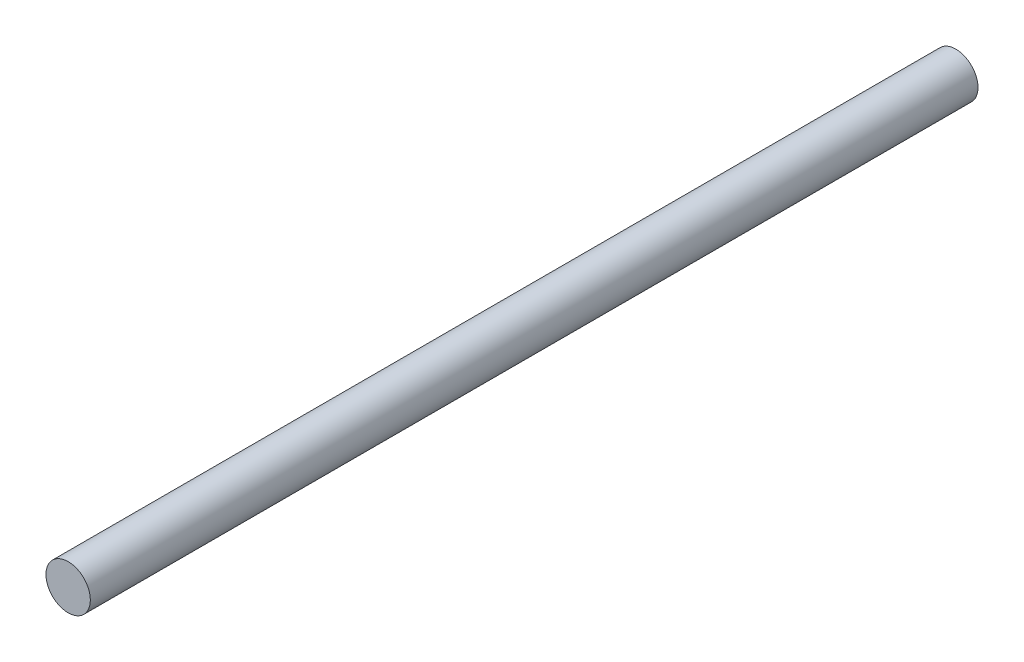
ISO-10303-21;
HEADER;
FILE_DESCRIPTION(('STEP AP214'),'2;1');
FILE_NAME('part.step','',(''),(''),'','','');
FILE_SCHEMA(('AUTOMOTIVE_DESIGN { 1 0 10303 214 1 1 1 1 }'));
ENDSEC;
DATA;
#1=APPLICATION_CONTEXT('core data for automotive mechanical design processes');
#2=APPLICATION_PROTOCOL_DEFINITION('international standard','automotive_design',2000,#1);
#3=PRODUCT_CONTEXT('',#1,'mechanical');
#4=PRODUCT('Part','Part','',(#3));
#5=PRODUCT_RELATED_PRODUCT_CATEGORY('part','',(#4));
#6=PRODUCT_DEFINITION_FORMATION('','',#4);
#7=PRODUCT_DEFINITION_CONTEXT('part definition',#1,'design');
#8=PRODUCT_DEFINITION('design','',#6,#7);
#9=PRODUCT_DEFINITION_SHAPE('','',#8);
#10=(LENGTH_UNIT() NAMED_UNIT(*) SI_UNIT(.MILLI.,.METRE.));
#11=(NAMED_UNIT(*) PLANE_ANGLE_UNIT() SI_UNIT($,.RADIAN.));
#12=(NAMED_UNIT(*) SI_UNIT($,.STERADIAN.) SOLID_ANGLE_UNIT());
#13=UNCERTAINTY_MEASURE_WITH_UNIT(LENGTH_MEASURE(1.E-05),#10,'distance_accuracy_value','');
#14=(GEOMETRIC_REPRESENTATION_CONTEXT(3) GLOBAL_UNCERTAINTY_ASSIGNED_CONTEXT((#13)) GLOBAL_UNIT_ASSIGNED_CONTEXT((#10,
#11,#12)) REPRESENTATION_CONTEXT('',''));
#15=CARTESIAN_POINT('',(0.,0.,0.));
#16=DIRECTION('',(0.,0.,1.));
#17=DIRECTION('',(1.,0.,0.));
#18=AXIS2_PLACEMENT_3D('',#15,#16,#17);
#19=CARTESIAN_POINT('',(0.,0.,180.));
#20=DIRECTION('',(0.,0.,-1.));
#21=DIRECTION('',(-1.,0.,0.));
#22=AXIS2_PLACEMENT_3D('',#19,#20,#21);
#23=CYLINDRICAL_SURFACE('',#22,4.5);
#24=CARTESIAN_POINT('',(0.,0.,180.));
#25=DIRECTION('',(0.,0.,1.));
#26=DIRECTION('',(1.,0.,0.));
#27=AXIS2_PLACEMENT_3D('',#24,#25,#26);
#28=CIRCLE('',#27,4.5);
#29=CARTESIAN_POINT('',(4.5,0.,180.));
#30=VERTEX_POINT('',#29);
#31=EDGE_CURVE('E10',#30,#30,#28,.T.);
#32=ORIENTED_EDGE('',*,*,#31,.F.);
#33=EDGE_LOOP('',(#32));
#34=FACE_BOUND('',#33,.T.);
#35=CARTESIAN_POINT('',(0.,0.,0.));
#36=DIRECTION('',(0.,0.,1.));
#37=DIRECTION('',(1.,0.,0.));
#38=AXIS2_PLACEMENT_3D('',#35,#36,#37);
#39=CIRCLE('',#38,4.5);
#40=CARTESIAN_POINT('',(4.5,0.,0.));
#41=VERTEX_POINT('',#40);
#42=EDGE_CURVE('E34',#41,#41,#39,.T.);
#43=ORIENTED_EDGE('',*,*,#42,.T.);
#44=EDGE_LOOP('',(#43));
#45=FACE_BOUND('',#44,.T.);
#46=ADVANCED_FACE('F31',(#34,#45),#23,.T.);
#47=CARTESIAN_POINT('',(0.,0.,180.));
#48=DIRECTION('',(0.,0.,1.));
#49=DIRECTION('',(1.,0.,0.));
#50=AXIS2_PLACEMENT_3D('',#47,#48,#49);
#51=PLANE('',#50);
#52=ORIENTED_EDGE('',*,*,#31,.T.);
#53=EDGE_LOOP('',(#52));
#54=FACE_BOUND('',#53,.T.);
#55=ADVANCED_FACE('F46',(#54),#51,.T.);
#56=CARTESIAN_POINT('',(0.,0.,0.));
#57=DIRECTION('',(0.,0.,1.));
#58=DIRECTION('',(1.,0.,0.));
#59=AXIS2_PLACEMENT_3D('',#56,#57,#58);
#60=PLANE('',#59);
#61=ORIENTED_EDGE('',*,*,#42,.F.);
#62=EDGE_LOOP('',(#61));
#63=FACE_BOUND('',#62,.T.);
#64=ADVANCED_FACE('F44',(#63),#60,.F.);
#65=CLOSED_SHELL('',(#46,#55,#64));
#66=MANIFOLD_SOLID_BREP('B2',#65);
#67=ADVANCED_BREP_SHAPE_REPRESENTATION('',(#18,#66),#14);
#68=SHAPE_DEFINITION_REPRESENTATION(#9,#67);
ENDSEC;
END-ISO-10303-21;
